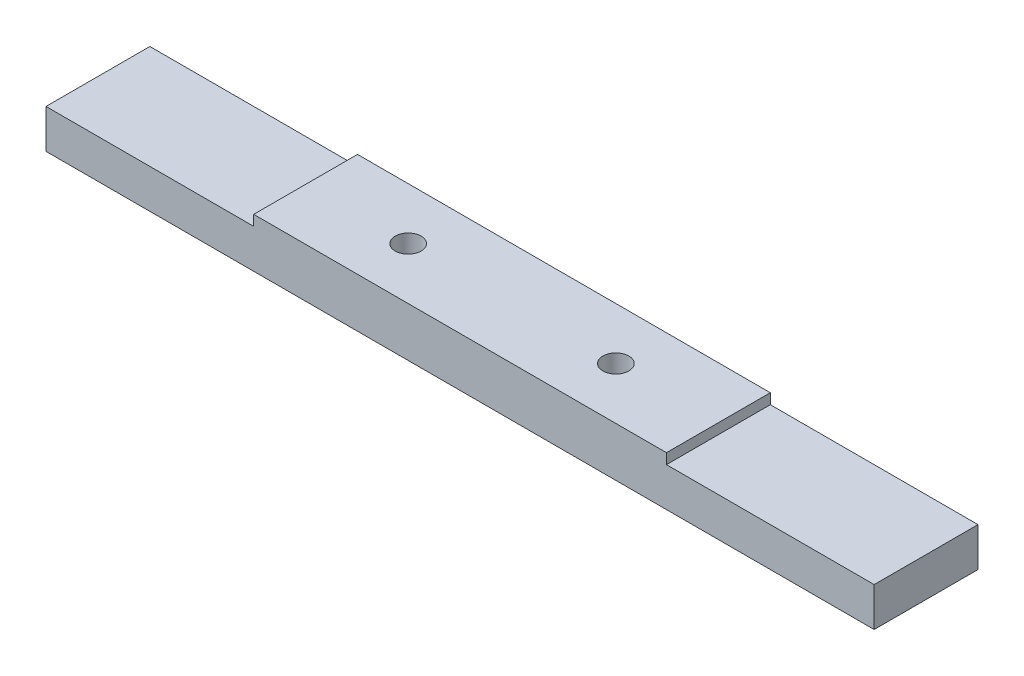
ISO-10303-21;
HEADER;
FILE_DESCRIPTION(('STEP AP214'),'2;1');
FILE_NAME('part.step','',(''),(''),'','','');
FILE_SCHEMA(('AUTOMOTIVE_DESIGN { 1 0 10303 214 1 1 1 1 }'));
ENDSEC;
DATA;
#1=APPLICATION_CONTEXT('core data for automotive mechanical design processes');
#2=APPLICATION_PROTOCOL_DEFINITION('international standard','automotive_design',2000,#1);
#3=PRODUCT_CONTEXT('',#1,'mechanical');
#4=PRODUCT('Part','Part','',(#3));
#5=PRODUCT_RELATED_PRODUCT_CATEGORY('part','',(#4));
#6=PRODUCT_DEFINITION_FORMATION('','',#4);
#7=PRODUCT_DEFINITION_CONTEXT('part definition',#1,'design');
#8=PRODUCT_DEFINITION('design','',#6,#7);
#9=PRODUCT_DEFINITION_SHAPE('','',#8);
#10=(LENGTH_UNIT() NAMED_UNIT(*) SI_UNIT(.MILLI.,.METRE.));
#11=(NAMED_UNIT(*) PLANE_ANGLE_UNIT() SI_UNIT($,.RADIAN.));
#12=(NAMED_UNIT(*) SI_UNIT($,.STERADIAN.) SOLID_ANGLE_UNIT());
#13=UNCERTAINTY_MEASURE_WITH_UNIT(LENGTH_MEASURE(1.E-05),#10,'distance_accuracy_value','');
#14=(GEOMETRIC_REPRESENTATION_CONTEXT(3) GLOBAL_UNCERTAINTY_ASSIGNED_CONTEXT((#13)) GLOBAL_UNIT_ASSIGNED_CONTEXT((#10,
#11,#12)) REPRESENTATION_CONTEXT('',''));
#15=CARTESIAN_POINT('',(0.,0.,0.));
#16=DIRECTION('',(0.,0.,1.));
#17=DIRECTION('',(1.,0.,0.));
#18=AXIS2_PLACEMENT_3D('',#15,#16,#17);
#19=CARTESIAN_POINT('',(-31.9,-3.,4.));
#20=DIRECTION('',(1.,0.,0.));
#21=DIRECTION('',(0.,0.,-1.));
#22=AXIS2_PLACEMENT_3D('',#19,#20,#21);
#23=PLANE('',#22);
#24=DIRECTION('',(0.,-1.,0.));
#25=VECTOR('',#24,1.);
#26=CARTESIAN_POINT('',(-31.9,-3.,-4.));
#27=LINE('',#26,#25);
#28=CARTESIAN_POINT('',(-31.9,0.,-4.));
#29=VERTEX_POINT('',#28);
#30=CARTESIAN_POINT('',(-31.9,-3.,-4.));
#31=VERTEX_POINT('',#30);
#32=EDGE_CURVE('E131',#29,#31,#27,.T.);
#33=ORIENTED_EDGE('',*,*,#32,.T.);
#34=DIRECTION('',(0.,0.,-1.));
#35=VECTOR('',#34,1.);
#36=CARTESIAN_POINT('',(-31.9,-3.,4.));
#37=LINE('',#36,#35);
#38=CARTESIAN_POINT('',(-31.9,-3.,4.));
#39=VERTEX_POINT('',#38);
#40=EDGE_CURVE('E11',#39,#31,#37,.T.);
#41=ORIENTED_EDGE('',*,*,#40,.F.);
#42=DIRECTION('',(0.,-1.,0.));
#43=VECTOR('',#42,1.);
#44=CARTESIAN_POINT('',(-31.9,-3.,4.));
#45=LINE('',#44,#43);
#46=CARTESIAN_POINT('',(-31.9,0.,4.));
#47=VERTEX_POINT('',#46);
#48=EDGE_CURVE('E146',#47,#39,#45,.T.);
#49=ORIENTED_EDGE('',*,*,#48,.F.);
#50=DIRECTION('',(0.,0.,-1.));
#51=VECTOR('',#50,1.);
#52=CARTESIAN_POINT('',(-31.9,0.,4.));
#53=LINE('',#52,#51);
#54=EDGE_CURVE('E127',#47,#29,#53,.T.);
#55=ORIENTED_EDGE('',*,*,#54,.T.);
#56=EDGE_LOOP('',(#33,#41,#49,#55));
#57=FACE_BOUND('',#56,.T.);
#58=ADVANCED_FACE('F35',(#57),#23,.F.);
#59=CARTESIAN_POINT('',(31.9,-2.99999999999999,4.));
#60=DIRECTION('',(0.,1.,0.));
#61=DIRECTION('',(-1.,0.,0.));
#62=AXIS2_PLACEMENT_3D('',#59,#60,#61);
#63=PLANE('',#62);
#64=CARTESIAN_POINT('',(-8.,-3.,0.));
#65=DIRECTION('',(0.,-1.,0.));
#66=DIRECTION('',(0.,0.,-1.));
#67=AXIS2_PLACEMENT_3D('',#64,#65,#66);
#68=CIRCLE('',#67,1.75);
#69=CARTESIAN_POINT('',(-8.,-3.,-1.75));
#70=VERTEX_POINT('',#69);
#71=EDGE_CURVE('E193',#70,#70,#68,.T.);
#72=ORIENTED_EDGE('',*,*,#71,.F.);
#73=EDGE_LOOP('',(#72));
#74=FACE_BOUND('',#73,.T.);
#75=CARTESIAN_POINT('',(8.,-3.,0.));
#76=DIRECTION('',(0.,-1.,0.));
#77=DIRECTION('',(0.,0.,-1.));
#78=AXIS2_PLACEMENT_3D('',#75,#76,#77);
#79=CIRCLE('',#78,1.75);
#80=CARTESIAN_POINT('',(8.,-3.,-1.75));
#81=VERTEX_POINT('',#80);
#82=EDGE_CURVE('E184',#81,#81,#79,.T.);
#83=ORIENTED_EDGE('',*,*,#82,.F.);
#84=EDGE_LOOP('',(#83));
#85=FACE_BOUND('',#84,.T.);
#86=DIRECTION('',(1.,0.,0.));
#87=VECTOR('',#86,1.);
#88=CARTESIAN_POINT('',(31.9,-2.99999999999999,-4.));
#89=LINE('',#88,#87);
#90=CARTESIAN_POINT('',(31.9,-2.99999999999999,-4.));
#91=VERTEX_POINT('',#90);
#92=EDGE_CURVE('E134',#31,#91,#89,.T.);
#93=ORIENTED_EDGE('',*,*,#92,.T.);
#94=DIRECTION('',(0.,0.,-1.));
#95=VECTOR('',#94,1.);
#96=CARTESIAN_POINT('',(31.9,-2.99999999999999,4.));
#97=LINE('',#96,#95);
#98=CARTESIAN_POINT('',(31.9,-2.99999999999999,4.));
#99=VERTEX_POINT('',#98);
#100=EDGE_CURVE('E43',#99,#91,#97,.T.);
#101=ORIENTED_EDGE('',*,*,#100,.F.);
#102=DIRECTION('',(1.,0.,0.));
#103=VECTOR('',#102,1.);
#104=CARTESIAN_POINT('',(31.9,-2.99999999999999,4.));
#105=LINE('',#104,#103);
#106=EDGE_CURVE('E94',#39,#99,#105,.T.);
#107=ORIENTED_EDGE('',*,*,#106,.F.);
#108=ORIENTED_EDGE('',*,*,#40,.T.);
#109=EDGE_LOOP('',(#93,#101,#107,#108));
#110=FACE_BOUND('',#109,.T.);
#111=ADVANCED_FACE('F199',(#74,#85,#110),#63,.F.);
#112=CARTESIAN_POINT('',(31.9,0.,4.));
#113=DIRECTION('',(-1.,0.,0.));
#114=DIRECTION('',(0.,0.,1.));
#115=AXIS2_PLACEMENT_3D('',#112,#113,#114);
#116=PLANE('',#115);
#117=DIRECTION('',(0.,1.,0.));
#118=VECTOR('',#117,1.);
#119=CARTESIAN_POINT('',(31.9,0.,-4.));
#120=LINE('',#119,#118);
#121=CARTESIAN_POINT('',(31.9,0.,-4.));
#122=VERTEX_POINT('',#121);
#123=EDGE_CURVE('E137',#91,#122,#120,.T.);
#124=ORIENTED_EDGE('',*,*,#123,.T.);
#125=DIRECTION('',(0.,0.,-1.));
#126=VECTOR('',#125,1.);
#127=CARTESIAN_POINT('',(31.9,0.,4.));
#128=LINE('',#127,#126);
#129=CARTESIAN_POINT('',(31.9,0.,4.));
#130=VERTEX_POINT('',#129);
#131=EDGE_CURVE('E153',#130,#122,#128,.T.);
#132=ORIENTED_EDGE('',*,*,#131,.F.);
#133=DIRECTION('',(0.,1.,0.));
#134=VECTOR('',#133,1.);
#135=CARTESIAN_POINT('',(31.9,0.,4.));
#136=LINE('',#135,#134);
#137=EDGE_CURVE('E161',#99,#130,#136,.T.);
#138=ORIENTED_EDGE('',*,*,#137,.F.);
#139=ORIENTED_EDGE('',*,*,#100,.T.);
#140=EDGE_LOOP('',(#124,#132,#138,#139));
#141=FACE_BOUND('',#140,.T.);
#142=ADVANCED_FACE('F159',(#141),#116,.F.);
#143=CARTESIAN_POINT('',(15.9,0.,4.));
#144=DIRECTION('',(0.,-1.,0.));
#145=DIRECTION('',(1.,0.,0.));
#146=AXIS2_PLACEMENT_3D('',#143,#144,#145);
#147=PLANE('',#146);
#148=DIRECTION('',(-1.,0.,0.));
#149=VECTOR('',#148,1.);
#150=CARTESIAN_POINT('',(15.9,0.,-4.));
#151=LINE('',#150,#149);
#152=CARTESIAN_POINT('',(15.9,0.,-4.));
#153=VERTEX_POINT('',#152);
#154=EDGE_CURVE('E139',#122,#153,#151,.T.);
#155=ORIENTED_EDGE('',*,*,#154,.T.);
#156=DIRECTION('',(0.,0.,-1.));
#157=VECTOR('',#156,1.);
#158=CARTESIAN_POINT('',(15.9,0.,4.));
#159=LINE('',#158,#157);
#160=CARTESIAN_POINT('',(15.9,0.,4.));
#161=VERTEX_POINT('',#160);
#162=EDGE_CURVE('E150',#161,#153,#159,.T.);
#163=ORIENTED_EDGE('',*,*,#162,.F.);
#164=DIRECTION('',(-1.,0.,0.));
#165=VECTOR('',#164,1.);
#166=CARTESIAN_POINT('',(15.9,0.,4.));
#167=LINE('',#166,#165);
#168=EDGE_CURVE('E173',#130,#161,#167,.T.);
#169=ORIENTED_EDGE('',*,*,#168,.F.);
#170=ORIENTED_EDGE('',*,*,#131,.T.);
#171=EDGE_LOOP('',(#155,#163,#169,#170));
#172=FACE_BOUND('',#171,.T.);
#173=ADVANCED_FACE('F169',(#172),#147,.F.);
#174=CARTESIAN_POINT('',(15.9,0.800000000000003,4.));
#175=DIRECTION('',(-1.,0.,0.));
#176=DIRECTION('',(0.,0.,1.));
#177=AXIS2_PLACEMENT_3D('',#174,#175,#176);
#178=PLANE('',#177);
#179=DIRECTION('',(0.,1.,0.));
#180=VECTOR('',#179,1.);
#181=CARTESIAN_POINT('',(15.9,0.800000000000003,-4.));
#182=LINE('',#181,#180);
#183=CARTESIAN_POINT('',(15.9,0.800000000000003,-4.));
#184=VERTEX_POINT('',#183);
#185=EDGE_CURVE('E141',#153,#184,#182,.T.);
#186=ORIENTED_EDGE('',*,*,#185,.T.);
#187=DIRECTION('',(0.,0.,-1.));
#188=VECTOR('',#187,1.);
#189=CARTESIAN_POINT('',(15.9,0.800000000000003,4.));
#190=LINE('',#189,#188);
#191=CARTESIAN_POINT('',(15.9,0.800000000000003,4.));
#192=VERTEX_POINT('',#191);
#193=EDGE_CURVE('E122',#192,#184,#190,.T.);
#194=ORIENTED_EDGE('',*,*,#193,.F.);
#195=DIRECTION('',(0.,1.,0.));
#196=VECTOR('',#195,1.);
#197=CARTESIAN_POINT('',(15.9,0.800000000000003,4.));
#198=LINE('',#197,#196);
#199=EDGE_CURVE('E113',#161,#192,#198,.T.);
#200=ORIENTED_EDGE('',*,*,#199,.F.);
#201=ORIENTED_EDGE('',*,*,#162,.T.);
#202=EDGE_LOOP('',(#186,#194,#200,#201));
#203=FACE_BOUND('',#202,.T.);
#204=ADVANCED_FACE('F172',(#203),#178,.F.);
#205=CARTESIAN_POINT('',(-15.9,0.8,4.));
#206=DIRECTION('',(0.,-1.,0.));
#207=DIRECTION('',(1.,0.,0.));
#208=AXIS2_PLACEMENT_3D('',#205,#206,#207);
#209=PLANE('',#208);
#210=CARTESIAN_POINT('',(-8.,0.800000000000006,0.));
#211=DIRECTION('',(0.,-1.,0.));
#212=DIRECTION('',(0.,0.,-1.));
#213=AXIS2_PLACEMENT_3D('',#210,#211,#212);
#214=CIRCLE('',#213,0.999999999999998);
#215=CARTESIAN_POINT('',(-8.,0.800000000000006,-0.999999999999998));
#216=VERTEX_POINT('',#215);
#217=EDGE_CURVE('E187',#216,#216,#214,.T.);
#218=ORIENTED_EDGE('',*,*,#217,.T.);
#219=EDGE_LOOP('',(#218));
#220=FACE_BOUND('',#219,.T.);
#221=CARTESIAN_POINT('',(8.,0.800000000000007,0.));
#222=DIRECTION('',(0.,-1.,0.));
#223=DIRECTION('',(0.,0.,-1.));
#224=AXIS2_PLACEMENT_3D('',#221,#222,#223);
#225=CIRCLE('',#224,0.999999999999999);
#226=CARTESIAN_POINT('',(8.,0.800000000000007,-0.999999999999999));
#227=VERTEX_POINT('',#226);
#228=EDGE_CURVE('E135',#227,#227,#225,.T.);
#229=ORIENTED_EDGE('',*,*,#228,.T.);
#230=EDGE_LOOP('',(#229));
#231=FACE_BOUND('',#230,.T.);
#232=DIRECTION('',(-1.,0.,0.));
#233=VECTOR('',#232,1.);
#234=CARTESIAN_POINT('',(-15.9,0.8,-4.));
#235=LINE('',#234,#233);
#236=CARTESIAN_POINT('',(-15.9,0.8,-4.));
#237=VERTEX_POINT('',#236);
#238=EDGE_CURVE('E121',#184,#237,#235,.T.);
#239=ORIENTED_EDGE('',*,*,#238,.T.);
#240=DIRECTION('',(0.,0.,-1.));
#241=VECTOR('',#240,1.);
#242=CARTESIAN_POINT('',(-15.9,0.8,4.));
#243=LINE('',#242,#241);
#244=CARTESIAN_POINT('',(-15.9,0.8,4.));
#245=VERTEX_POINT('',#244);
#246=EDGE_CURVE('E118',#245,#237,#243,.T.);
#247=ORIENTED_EDGE('',*,*,#246,.F.);
#248=DIRECTION('',(-1.,0.,0.));
#249=VECTOR('',#248,1.);
#250=CARTESIAN_POINT('',(-15.9,0.8,4.));
#251=LINE('',#250,#249);
#252=EDGE_CURVE('E107',#192,#245,#251,.T.);
#253=ORIENTED_EDGE('',*,*,#252,.F.);
#254=ORIENTED_EDGE('',*,*,#193,.T.);
#255=EDGE_LOOP('',(#239,#247,#253,#254));
#256=FACE_BOUND('',#255,.T.);
#257=ADVANCED_FACE('F119',(#220,#231,#256),#209,.F.);
#258=CARTESIAN_POINT('',(-15.9,0.,4.));
#259=DIRECTION('',(1.,0.,0.));
#260=DIRECTION('',(0.,0.,-1.));
#261=AXIS2_PLACEMENT_3D('',#258,#259,#260);
#262=PLANE('',#261);
#263=DIRECTION('',(0.,-1.,0.));
#264=VECTOR('',#263,1.);
#265=CARTESIAN_POINT('',(-15.9,0.,-4.));
#266=LINE('',#265,#264);
#267=CARTESIAN_POINT('',(-15.9,0.,-4.));
#268=VERTEX_POINT('',#267);
#269=EDGE_CURVE('E80',#237,#268,#266,.T.);
#270=ORIENTED_EDGE('',*,*,#269,.T.);
#271=DIRECTION('',(0.,0.,-1.));
#272=VECTOR('',#271,1.);
#273=CARTESIAN_POINT('',(-15.9,0.,4.));
#274=LINE('',#273,#272);
#275=CARTESIAN_POINT('',(-15.9,0.,4.));
#276=VERTEX_POINT('',#275);
#277=EDGE_CURVE('E123',#276,#268,#274,.T.);
#278=ORIENTED_EDGE('',*,*,#277,.F.);
#279=DIRECTION('',(0.,-1.,0.));
#280=VECTOR('',#279,1.);
#281=CARTESIAN_POINT('',(-15.9,0.,4.));
#282=LINE('',#281,#280);
#283=EDGE_CURVE('E111',#245,#276,#282,.T.);
#284=ORIENTED_EDGE('',*,*,#283,.F.);
#285=ORIENTED_EDGE('',*,*,#246,.T.);
#286=EDGE_LOOP('',(#270,#278,#284,#285));
#287=FACE_BOUND('',#286,.T.);
#288=ADVANCED_FACE('F125',(#287),#262,.F.);
#289=CARTESIAN_POINT('',(-31.9,0.,4.));
#290=DIRECTION('',(0.,-1.,0.));
#291=DIRECTION('',(0.,0.,-1.));
#292=AXIS2_PLACEMENT_3D('',#289,#290,#291);
#293=PLANE('',#292);
#294=DIRECTION('',(-1.,0.,0.));
#295=VECTOR('',#294,1.);
#296=CARTESIAN_POINT('',(-31.9,0.,-4.));
#297=LINE('',#296,#295);
#298=EDGE_CURVE('E86',#268,#29,#297,.T.);
#299=ORIENTED_EDGE('',*,*,#298,.T.);
#300=ORIENTED_EDGE('',*,*,#54,.F.);
#301=DIRECTION('',(-1.,0.,0.));
#302=VECTOR('',#301,1.);
#303=CARTESIAN_POINT('',(-31.9,0.,4.));
#304=LINE('',#303,#302);
#305=EDGE_CURVE('E51',#276,#47,#304,.T.);
#306=ORIENTED_EDGE('',*,*,#305,.F.);
#307=ORIENTED_EDGE('',*,*,#277,.T.);
#308=EDGE_LOOP('',(#299,#300,#306,#307));
#309=FACE_BOUND('',#308,.T.);
#310=ADVANCED_FACE('F206',(#309),#293,.F.);
#311=CARTESIAN_POINT('',(0.,0.,4.));
#312=DIRECTION('',(0.,0.,-1.));
#313=DIRECTION('',(-1.,0.,0.));
#314=AXIS2_PLACEMENT_3D('',#311,#312,#313);
#315=PLANE('',#314);
#316=ORIENTED_EDGE('',*,*,#48,.T.);
#317=ORIENTED_EDGE('',*,*,#106,.T.);
#318=ORIENTED_EDGE('',*,*,#137,.T.);
#319=ORIENTED_EDGE('',*,*,#168,.T.);
#320=ORIENTED_EDGE('',*,*,#199,.T.);
#321=ORIENTED_EDGE('',*,*,#252,.T.);
#322=ORIENTED_EDGE('',*,*,#283,.T.);
#323=ORIENTED_EDGE('',*,*,#305,.T.);
#324=EDGE_LOOP('',(#316,#317,#318,#319,#320,#321,#322,#323));
#325=FACE_BOUND('',#324,.T.);
#326=ADVANCED_FACE('F109',(#325),#315,.F.);
#327=CARTESIAN_POINT('',(0.,0.,-4.));
#328=DIRECTION('',(0.,0.,-1.));
#329=DIRECTION('',(-1.,0.,0.));
#330=AXIS2_PLACEMENT_3D('',#327,#328,#329);
#331=PLANE('',#330);
#332=ORIENTED_EDGE('',*,*,#32,.F.);
#333=ORIENTED_EDGE('',*,*,#298,.F.);
#334=ORIENTED_EDGE('',*,*,#269,.F.);
#335=ORIENTED_EDGE('',*,*,#238,.F.);
#336=ORIENTED_EDGE('',*,*,#185,.F.);
#337=ORIENTED_EDGE('',*,*,#154,.F.);
#338=ORIENTED_EDGE('',*,*,#123,.F.);
#339=ORIENTED_EDGE('',*,*,#92,.F.);
#340=EDGE_LOOP('',(#332,#333,#334,#335,#336,#337,#338,#339));
#341=FACE_BOUND('',#340,.T.);
#342=ADVANCED_FACE('F165',(#341),#331,.T.);
#343=CARTESIAN_POINT('',(8.,-3.,0.));
#344=DIRECTION('',(0.,-1.,0.));
#345=DIRECTION('',(0.,0.,-1.));
#346=AXIS2_PLACEMENT_3D('',#343,#344,#345);
#347=CYLINDRICAL_SURFACE('',#346,0.999999999999999);
#348=ORIENTED_EDGE('',*,*,#228,.F.);
#349=EDGE_LOOP('',(#348));
#350=FACE_BOUND('',#349,.T.);
#351=CARTESIAN_POINT('',(8.,-2.24999999999999,0.));
#352=DIRECTION('',(0.,-1.,0.));
#353=DIRECTION('',(0.,0.,-1.));
#354=AXIS2_PLACEMENT_3D('',#351,#352,#353);
#355=CIRCLE('',#354,0.999999999999999);
#356=CARTESIAN_POINT('',(8.,-2.24999999999999,-0.999999999999999));
#357=VERTEX_POINT('',#356);
#358=EDGE_CURVE('E181',#357,#357,#355,.T.);
#359=ORIENTED_EDGE('',*,*,#358,.T.);
#360=EDGE_LOOP('',(#359));
#361=FACE_BOUND('',#360,.T.);
#362=ADVANCED_FACE('F271',(#350,#361),#347,.F.);
#363=CARTESIAN_POINT('',(8.,-3.,0.));
#364=DIRECTION('',(0.,-1.,0.));
#365=DIRECTION('',(0.,0.,-1.));
#366=AXIS2_PLACEMENT_3D('',#363,#364,#365);
#367=CONICAL_SURFACE('',#366,1.75,0.785398163397447);
#368=ORIENTED_EDGE('',*,*,#358,.F.);
#369=EDGE_LOOP('',(#368));
#370=FACE_BOUND('',#369,.T.);
#371=ORIENTED_EDGE('',*,*,#82,.T.);
#372=EDGE_LOOP('',(#371));
#373=FACE_BOUND('',#372,.T.);
#374=ADVANCED_FACE('F279',(#370,#373),#367,.F.);
#375=CARTESIAN_POINT('',(-8.,-3.,0.));
#376=DIRECTION('',(0.,-1.,0.));
#377=DIRECTION('',(0.,0.,-1.));
#378=AXIS2_PLACEMENT_3D('',#375,#376,#377);
#379=CYLINDRICAL_SURFACE('',#378,0.999999999999999);
#380=ORIENTED_EDGE('',*,*,#217,.F.);
#381=EDGE_LOOP('',(#380));
#382=FACE_BOUND('',#381,.T.);
#383=CARTESIAN_POINT('',(-8.,-2.25,0.));
#384=DIRECTION('',(0.,-1.,0.));
#385=DIRECTION('',(0.,0.,-1.));
#386=AXIS2_PLACEMENT_3D('',#383,#384,#385);
#387=CIRCLE('',#386,0.999999999999999);
#388=CARTESIAN_POINT('',(-8.,-2.25,-0.999999999999999));
#389=VERTEX_POINT('',#388);
#390=EDGE_CURVE('E190',#389,#389,#387,.T.);
#391=ORIENTED_EDGE('',*,*,#390,.T.);
#392=EDGE_LOOP('',(#391));
#393=FACE_BOUND('',#392,.T.);
#394=ADVANCED_FACE('F286',(#382,#393),#379,.F.);
#395=CARTESIAN_POINT('',(-8.,-3.,0.));
#396=DIRECTION('',(0.,-1.,0.));
#397=DIRECTION('',(0.,0.,-1.));
#398=AXIS2_PLACEMENT_3D('',#395,#396,#397);
#399=CONICAL_SURFACE('',#398,1.75,0.785398163397447);
#400=ORIENTED_EDGE('',*,*,#390,.F.);
#401=EDGE_LOOP('',(#400));
#402=FACE_BOUND('',#401,.T.);
#403=ORIENTED_EDGE('',*,*,#71,.T.);
#404=EDGE_LOOP('',(#403));
#405=FACE_BOUND('',#404,.T.);
#406=ADVANCED_FACE('F197',(#402,#405),#399,.F.);
#407=CLOSED_SHELL('',(#58,#111,#142,#173,#204,#257,#288,#310,#326,#342,#362,#374,#394,#406));
#408=MANIFOLD_SOLID_BREP('B2',#407);
#409=ADVANCED_BREP_SHAPE_REPRESENTATION('',(#18,#408),#14);
#410=SHAPE_DEFINITION_REPRESENTATION(#9,#409);
ENDSEC;
END-ISO-10303-21;
